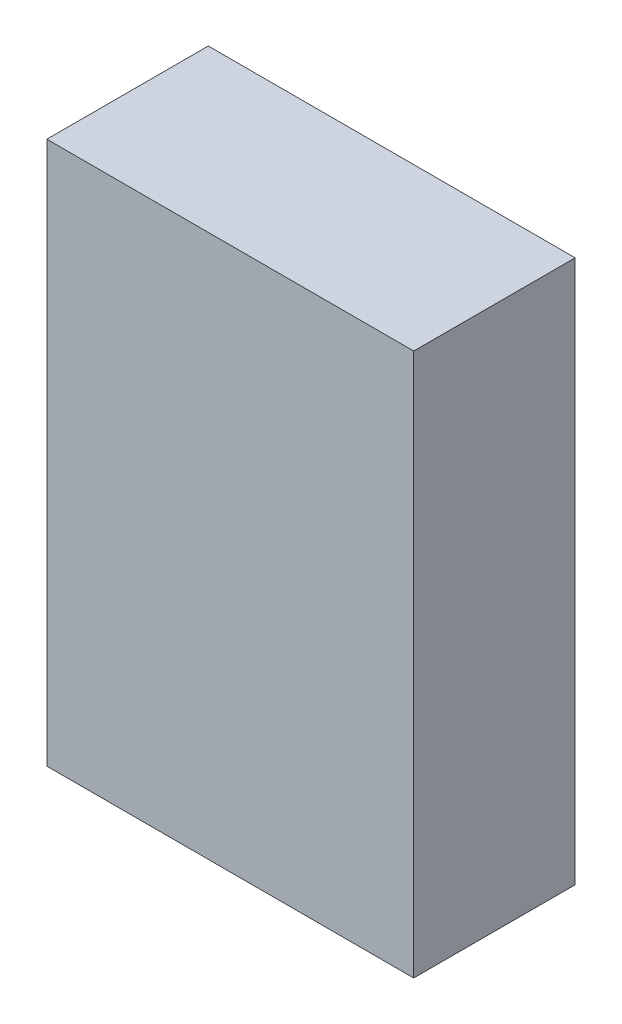
ISO-10303-21;
HEADER;
FILE_DESCRIPTION(('STEP AP214'),'2;1');
FILE_NAME('part.step','',(''),(''),'','','');
FILE_SCHEMA(('AUTOMOTIVE_DESIGN { 1 0 10303 214 1 1 1 1 }'));
ENDSEC;
DATA;
#1=APPLICATION_CONTEXT('core data for automotive mechanical design processes');
#2=APPLICATION_PROTOCOL_DEFINITION('international standard','automotive_design',2000,#1);
#3=PRODUCT_CONTEXT('',#1,'mechanical');
#4=PRODUCT('Part','Part','',(#3));
#5=PRODUCT_RELATED_PRODUCT_CATEGORY('part','',(#4));
#6=PRODUCT_DEFINITION_FORMATION('','',#4);
#7=PRODUCT_DEFINITION_CONTEXT('part definition',#1,'design');
#8=PRODUCT_DEFINITION('design','',#6,#7);
#9=PRODUCT_DEFINITION_SHAPE('','',#8);
#10=(LENGTH_UNIT() NAMED_UNIT(*) SI_UNIT(.MILLI.,.METRE.));
#11=(NAMED_UNIT(*) PLANE_ANGLE_UNIT() SI_UNIT($,.RADIAN.));
#12=(NAMED_UNIT(*) SI_UNIT($,.STERADIAN.) SOLID_ANGLE_UNIT());
#13=UNCERTAINTY_MEASURE_WITH_UNIT(LENGTH_MEASURE(1.E-05),#10,'distance_accuracy_value','');
#14=(GEOMETRIC_REPRESENTATION_CONTEXT(3) GLOBAL_UNCERTAINTY_ASSIGNED_CONTEXT((#13)) GLOBAL_UNIT_ASSIGNED_CONTEXT((#10,
#11,#12)) REPRESENTATION_CONTEXT('',''));
#15=CARTESIAN_POINT('',(0.,0.,0.));
#16=DIRECTION('',(0.,0.,1.));
#17=DIRECTION('',(1.,0.,0.));
#18=AXIS2_PLACEMENT_3D('',#15,#16,#17);
#19=CARTESIAN_POINT('',(3.75000012,5.5500016,3.30000102));
#20=DIRECTION('',(0.,0.,1.));
#21=DIRECTION('',(1.,0.,0.));
#22=AXIS2_PLACEMENT_3D('',#19,#20,#21);
#23=PLANE('',#22);
#24=DIRECTION('',(1.,0.,0.));
#25=VECTOR('',#24,1.);
#26=CARTESIAN_POINT('',(3.75000012,-5.54999906,3.30000102));
#27=LINE('',#26,#25);
#28=CARTESIAN_POINT('',(3.75000012,-5.54999906,3.30000102));
#29=VERTEX_POINT('',#28);
#30=CARTESIAN_POINT('',(-3.75000012,-5.54999906,3.30000102));
#31=VERTEX_POINT('',#30);
#32=EDGE_CURVE('E52',#29,#31,#27,.F.);
#33=ORIENTED_EDGE('',*,*,#32,.F.);
#34=DIRECTION('',(0.,1.,0.));
#35=VECTOR('',#34,1.);
#36=CARTESIAN_POINT('',(3.75000012,5.5500016,3.30000102));
#37=LINE('',#36,#35);
#38=CARTESIAN_POINT('',(3.75000012,5.5500016,3.30000102));
#39=VERTEX_POINT('',#38);
#40=EDGE_CURVE('E67',#39,#29,#37,.F.);
#41=ORIENTED_EDGE('',*,*,#40,.F.);
#42=DIRECTION('',(1.,0.,0.));
#43=VECTOR('',#42,1.);
#44=CARTESIAN_POINT('',(-3.75000012,5.5500016,3.30000102));
#45=LINE('',#44,#43);
#46=CARTESIAN_POINT('',(-3.75000012,5.5500016,3.30000102));
#47=VERTEX_POINT('',#46);
#48=EDGE_CURVE('E19',#47,#39,#45,.T.);
#49=ORIENTED_EDGE('',*,*,#48,.F.);
#50=DIRECTION('',(0.,1.,0.));
#51=VECTOR('',#50,1.);
#52=CARTESIAN_POINT('',(-3.75000012,-5.54999906,3.30000102));
#53=LINE('',#52,#51);
#54=EDGE_CURVE('E57',#31,#47,#53,.T.);
#55=ORIENTED_EDGE('',*,*,#54,.F.);
#56=EDGE_LOOP('',(#33,#41,#49,#55));
#57=FACE_BOUND('',#56,.T.);
#58=ADVANCED_FACE('F16',(#57),#23,.T.);
#59=CARTESIAN_POINT('',(-3.75000012,5.5500016,0.));
#60=DIRECTION('',(0.,1.,0.));
#61=DIRECTION('',(0.,0.,1.));
#62=AXIS2_PLACEMENT_3D('',#59,#60,#61);
#63=PLANE('',#62);
#64=DIRECTION('',(0.,0.,-1.));
#65=VECTOR('',#64,1.);
#66=CARTESIAN_POINT('',(3.75000012,5.5500016,0.));
#67=LINE('',#66,#65);
#68=CARTESIAN_POINT('',(3.75000012,5.5500016,0.));
#69=VERTEX_POINT('',#68);
#70=EDGE_CURVE('E78',#69,#39,#67,.F.);
#71=ORIENTED_EDGE('',*,*,#70,.F.);
#72=DIRECTION('',(1.,0.,0.));
#73=VECTOR('',#72,1.);
#74=CARTESIAN_POINT('',(3.75000012,5.5500016,0.));
#75=LINE('',#74,#73);
#76=CARTESIAN_POINT('',(-3.75000012,5.5500016,0.));
#77=VERTEX_POINT('',#76);
#78=EDGE_CURVE('E73',#69,#77,#75,.F.);
#79=ORIENTED_EDGE('',*,*,#78,.T.);
#80=DIRECTION('',(0.,0.,1.));
#81=VECTOR('',#80,1.);
#82=CARTESIAN_POINT('',(-3.75000012,5.5500016,0.));
#83=LINE('',#82,#81);
#84=EDGE_CURVE('E62',#47,#77,#83,.F.);
#85=ORIENTED_EDGE('',*,*,#84,.F.);
#86=ORIENTED_EDGE('',*,*,#48,.T.);
#87=EDGE_LOOP('',(#71,#79,#85,#86));
#88=FACE_BOUND('',#87,.T.);
#89=ADVANCED_FACE('F72',(#88),#63,.T.);
#90=CARTESIAN_POINT('',(-3.75000012,-5.54999906,0.));
#91=DIRECTION('',(-1.,0.,0.));
#92=DIRECTION('',(0.,0.,1.));
#93=AXIS2_PLACEMENT_3D('',#90,#91,#92);
#94=PLANE('',#93);
#95=ORIENTED_EDGE('',*,*,#84,.T.);
#96=DIRECTION('',(0.,1.,0.));
#97=VECTOR('',#96,1.);
#98=CARTESIAN_POINT('',(-3.75000012,5.5500016,0.));
#99=LINE('',#98,#97);
#100=CARTESIAN_POINT('',(-3.75000012,-5.54999906,0.));
#101=VERTEX_POINT('',#100);
#102=EDGE_CURVE('E83',#77,#101,#99,.F.);
#103=ORIENTED_EDGE('',*,*,#102,.T.);
#104=DIRECTION('',(0.,0.,-1.));
#105=VECTOR('',#104,1.);
#106=CARTESIAN_POINT('',(-3.75000012,-5.54999906,0.));
#107=LINE('',#106,#105);
#108=EDGE_CURVE('E64',#31,#101,#107,.T.);
#109=ORIENTED_EDGE('',*,*,#108,.F.);
#110=ORIENTED_EDGE('',*,*,#54,.T.);
#111=EDGE_LOOP('',(#95,#103,#109,#110));
#112=FACE_BOUND('',#111,.T.);
#113=ADVANCED_FACE('F59',(#112),#94,.T.);
#114=CARTESIAN_POINT('',(3.75000012,-5.54999906,0.));
#115=DIRECTION('',(0.,-1.,0.));
#116=DIRECTION('',(0.,0.,-1.));
#117=AXIS2_PLACEMENT_3D('',#114,#115,#116);
#118=PLANE('',#117);
#119=ORIENTED_EDGE('',*,*,#108,.T.);
#120=DIRECTION('',(1.,0.,0.));
#121=VECTOR('',#120,1.);
#122=CARTESIAN_POINT('',(3.75000012,-5.54999906,0.));
#123=LINE('',#122,#121);
#124=CARTESIAN_POINT('',(3.75000012,-5.54999906,0.));
#125=VERTEX_POINT('',#124);
#126=EDGE_CURVE('E25',#101,#125,#123,.T.);
#127=ORIENTED_EDGE('',*,*,#126,.T.);
#128=DIRECTION('',(0.,0.,-1.));
#129=VECTOR('',#128,1.);
#130=CARTESIAN_POINT('',(3.75000012,-5.54999906,0.));
#131=LINE('',#130,#129);
#132=EDGE_CURVE('E33',#29,#125,#131,.T.);
#133=ORIENTED_EDGE('',*,*,#132,.F.);
#134=ORIENTED_EDGE('',*,*,#32,.T.);
#135=EDGE_LOOP('',(#119,#127,#133,#134));
#136=FACE_BOUND('',#135,.T.);
#137=ADVANCED_FACE('F87',(#136),#118,.T.);
#138=CARTESIAN_POINT('',(3.75000012,5.5500016,0.));
#139=DIRECTION('',(1.,0.,0.));
#140=DIRECTION('',(0.,0.,-1.));
#141=AXIS2_PLACEMENT_3D('',#138,#139,#140);
#142=PLANE('',#141);
#143=ORIENTED_EDGE('',*,*,#132,.T.);
#144=DIRECTION('',(0.,1.,0.));
#145=VECTOR('',#144,1.);
#146=CARTESIAN_POINT('',(3.75000012,5.5500016,0.));
#147=LINE('',#146,#145);
#148=EDGE_CURVE('E10',#125,#69,#147,.T.);
#149=ORIENTED_EDGE('',*,*,#148,.T.);
#150=ORIENTED_EDGE('',*,*,#70,.T.);
#151=ORIENTED_EDGE('',*,*,#40,.T.);
#152=EDGE_LOOP('',(#143,#149,#150,#151));
#153=FACE_BOUND('',#152,.T.);
#154=ADVANCED_FACE('F90',(#153),#142,.T.);
#155=CARTESIAN_POINT('',(3.75000012,5.5500016,0.));
#156=DIRECTION('',(0.,0.,1.));
#157=DIRECTION('',(1.,0.,0.));
#158=AXIS2_PLACEMENT_3D('',#155,#156,#157);
#159=PLANE('',#158);
#160=ORIENTED_EDGE('',*,*,#126,.F.);
#161=ORIENTED_EDGE('',*,*,#102,.F.);
#162=ORIENTED_EDGE('',*,*,#78,.F.);
#163=ORIENTED_EDGE('',*,*,#148,.F.);
#164=EDGE_LOOP('',(#160,#161,#162,#163));
#165=FACE_BOUND('',#164,.T.);
#166=ADVANCED_FACE('F89',(#165),#159,.F.);
#167=CLOSED_SHELL('',(#58,#89,#113,#137,#154,#166));
#168=MANIFOLD_SOLID_BREP('B1',#167);
#169=ADVANCED_BREP_SHAPE_REPRESENTATION('',(#18,#168),#14);
#170=SHAPE_DEFINITION_REPRESENTATION(#9,#169);
ENDSEC;
END-ISO-10303-21;
